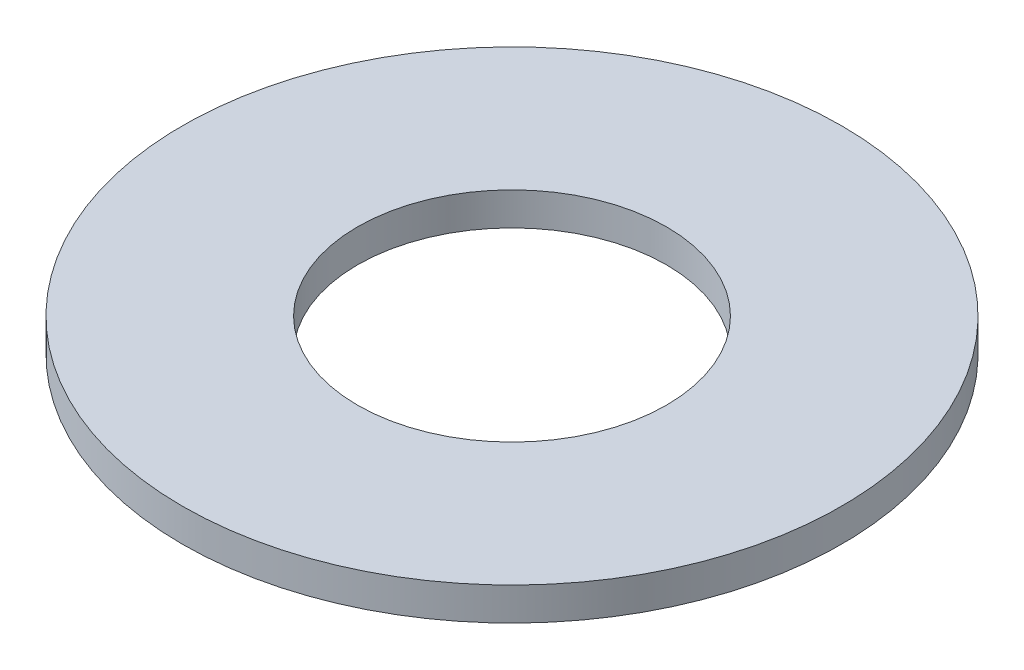
ISO-10303-21;
HEADER;
FILE_DESCRIPTION(('STEP AP214'),'2;1');
FILE_NAME('part.step','',(''),(''),'','','');
FILE_SCHEMA(('AUTOMOTIVE_DESIGN { 1 0 10303 214 1 1 1 1 }'));
ENDSEC;
DATA;
#1=APPLICATION_CONTEXT('core data for automotive mechanical design processes');
#2=APPLICATION_PROTOCOL_DEFINITION('international standard','automotive_design',2000,#1);
#3=PRODUCT_CONTEXT('',#1,'mechanical');
#4=PRODUCT('Part','Part','',(#3));
#5=PRODUCT_RELATED_PRODUCT_CATEGORY('part','',(#4));
#6=PRODUCT_DEFINITION_FORMATION('','',#4);
#7=PRODUCT_DEFINITION_CONTEXT('part definition',#1,'design');
#8=PRODUCT_DEFINITION('design','',#6,#7);
#9=PRODUCT_DEFINITION_SHAPE('','',#8);
#10=(LENGTH_UNIT() NAMED_UNIT(*) SI_UNIT(.MILLI.,.METRE.));
#11=(NAMED_UNIT(*) PLANE_ANGLE_UNIT() SI_UNIT($,.RADIAN.));
#12=(NAMED_UNIT(*) SI_UNIT($,.STERADIAN.) SOLID_ANGLE_UNIT());
#13=UNCERTAINTY_MEASURE_WITH_UNIT(LENGTH_MEASURE(1.E-05),#10,'distance_accuracy_value','');
#14=(GEOMETRIC_REPRESENTATION_CONTEXT(3) GLOBAL_UNCERTAINTY_ASSIGNED_CONTEXT((#13)) GLOBAL_UNIT_ASSIGNED_CONTEXT((#10,
#11,#12)) REPRESENTATION_CONTEXT('',''));
#15=CARTESIAN_POINT('',(0.,0.,0.));
#16=DIRECTION('',(0.,0.,1.));
#17=DIRECTION('',(1.,0.,0.));
#18=AXIS2_PLACEMENT_3D('',#15,#16,#17);
#19=CARTESIAN_POINT('',(0.,8.,0.));
#20=DIRECTION('',(0.,-1.,0.));
#21=DIRECTION('',(0.,0.,-1.));
#22=AXIS2_PLACEMENT_3D('',#19,#20,#21);
#23=CYLINDRICAL_SURFACE('',#22,80.);
#24=CARTESIAN_POINT('',(0.,8.,0.));
#25=DIRECTION('',(0.,1.,0.));
#26=DIRECTION('',(0.,0.,1.));
#27=AXIS2_PLACEMENT_3D('',#24,#25,#26);
#28=CIRCLE('',#27,80.);
#29=CARTESIAN_POINT('',(0.,8.,80.));
#30=VERTEX_POINT('',#29);
#31=EDGE_CURVE('E10',#30,#30,#28,.T.);
#32=ORIENTED_EDGE('',*,*,#31,.F.);
#33=EDGE_LOOP('',(#32));
#34=FACE_BOUND('',#33,.T.);
#35=CARTESIAN_POINT('',(0.,0.,0.));
#36=DIRECTION('',(0.,1.,0.));
#37=DIRECTION('',(0.,0.,1.));
#38=AXIS2_PLACEMENT_3D('',#35,#36,#37);
#39=CIRCLE('',#38,80.);
#40=CARTESIAN_POINT('',(0.,0.,80.));
#41=VERTEX_POINT('',#40);
#42=EDGE_CURVE('E37',#41,#41,#39,.T.);
#43=ORIENTED_EDGE('',*,*,#42,.T.);
#44=EDGE_LOOP('',(#43));
#45=FACE_BOUND('',#44,.T.);
#46=ADVANCED_FACE('F40',(#34,#45),#23,.T.);
#47=CARTESIAN_POINT('',(0.,8.,0.));
#48=DIRECTION('',(0.,1.,0.));
#49=DIRECTION('',(0.,0.,1.));
#50=AXIS2_PLACEMENT_3D('',#47,#48,#49);
#51=PLANE('',#50);
#52=CARTESIAN_POINT('',(0.,8.,0.));
#53=DIRECTION('',(0.,1.,0.));
#54=DIRECTION('',(0.,0.,1.));
#55=AXIS2_PLACEMENT_3D('',#52,#53,#54);
#56=CIRCLE('',#55,37.5);
#57=CARTESIAN_POINT('',(0.,8.,37.5));
#58=VERTEX_POINT('',#57);
#59=EDGE_CURVE('E50',#58,#58,#56,.T.);
#60=ORIENTED_EDGE('',*,*,#59,.F.);
#61=EDGE_LOOP('',(#60));
#62=FACE_BOUND('',#61,.T.);
#63=ORIENTED_EDGE('',*,*,#31,.T.);
#64=EDGE_LOOP('',(#63));
#65=FACE_BOUND('',#64,.T.);
#66=ADVANCED_FACE('F59',(#62,#65),#51,.T.);
#67=CARTESIAN_POINT('',(0.,0.,0.));
#68=DIRECTION('',(0.,1.,0.));
#69=DIRECTION('',(0.,0.,1.));
#70=AXIS2_PLACEMENT_3D('',#67,#68,#69);
#71=PLANE('',#70);
#72=CARTESIAN_POINT('',(0.,0.,0.));
#73=DIRECTION('',(0.,1.,0.));
#74=DIRECTION('',(0.,0.,1.));
#75=AXIS2_PLACEMENT_3D('',#72,#73,#74);
#76=CIRCLE('',#75,37.5);
#77=CARTESIAN_POINT('',(0.,0.,37.5));
#78=VERTEX_POINT('',#77);
#79=EDGE_CURVE('E47',#78,#78,#76,.T.);
#80=ORIENTED_EDGE('',*,*,#79,.T.);
#81=EDGE_LOOP('',(#80));
#82=FACE_BOUND('',#81,.T.);
#83=ORIENTED_EDGE('',*,*,#42,.F.);
#84=EDGE_LOOP('',(#83));
#85=FACE_BOUND('',#84,.T.);
#86=ADVANCED_FACE('F58',(#82,#85),#71,.F.);
#87=CARTESIAN_POINT('',(0.,8.,0.));
#88=DIRECTION('',(0.,-1.,0.));
#89=DIRECTION('',(0.,0.,-1.));
#90=AXIS2_PLACEMENT_3D('',#87,#88,#89);
#91=CYLINDRICAL_SURFACE('',#90,37.5);
#92=ORIENTED_EDGE('',*,*,#59,.T.);
#93=EDGE_LOOP('',(#92));
#94=FACE_BOUND('',#93,.T.);
#95=ORIENTED_EDGE('',*,*,#79,.F.);
#96=EDGE_LOOP('',(#95));
#97=FACE_BOUND('',#96,.T.);
#98=ADVANCED_FACE('F54',(#94,#97),#91,.F.);
#99=CLOSED_SHELL('',(#46,#66,#86,#98));
#100=MANIFOLD_SOLID_BREP('B2',#99);
#101=ADVANCED_BREP_SHAPE_REPRESENTATION('',(#18,#100),#14);
#102=SHAPE_DEFINITION_REPRESENTATION(#9,#101);
ENDSEC;
END-ISO-10303-21;
